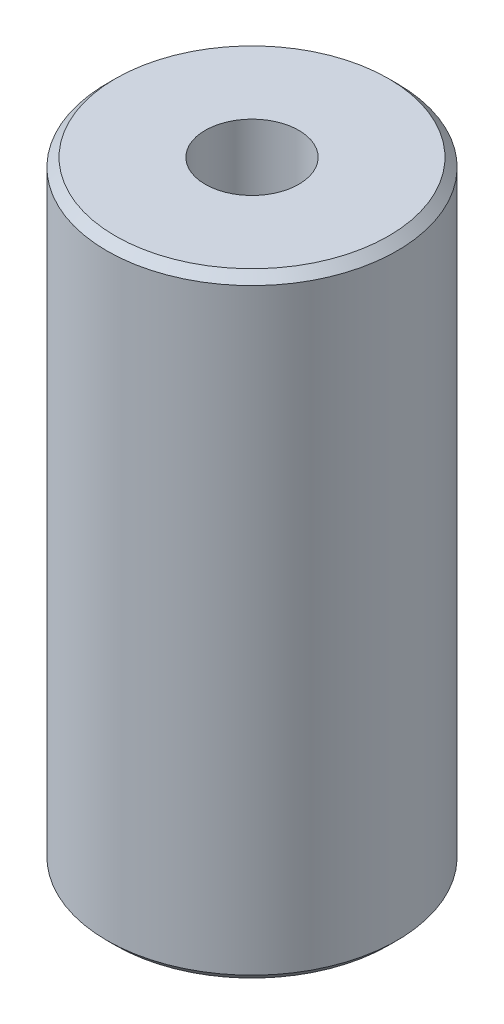
ISO-10303-21;
HEADER;
FILE_DESCRIPTION(('STEP AP214'),'2;1');
FILE_NAME('part.step','',(''),(''),'','','');
FILE_SCHEMA(('AUTOMOTIVE_DESIGN { 1 0 10303 214 1 1 1 1 }'));
ENDSEC;
DATA;
#1=APPLICATION_CONTEXT('core data for automotive mechanical design processes');
#2=APPLICATION_PROTOCOL_DEFINITION('international standard','automotive_design',2000,#1);
#3=PRODUCT_CONTEXT('',#1,'mechanical');
#4=PRODUCT('Part','Part','',(#3));
#5=PRODUCT_RELATED_PRODUCT_CATEGORY('part','',(#4));
#6=PRODUCT_DEFINITION_FORMATION('','',#4);
#7=PRODUCT_DEFINITION_CONTEXT('part definition',#1,'design');
#8=PRODUCT_DEFINITION('design','',#6,#7);
#9=PRODUCT_DEFINITION_SHAPE('','',#8);
#10=(LENGTH_UNIT() NAMED_UNIT(*) SI_UNIT(.MILLI.,.METRE.));
#11=(NAMED_UNIT(*) PLANE_ANGLE_UNIT() SI_UNIT($,.RADIAN.));
#12=(NAMED_UNIT(*) SI_UNIT($,.STERADIAN.) SOLID_ANGLE_UNIT());
#13=UNCERTAINTY_MEASURE_WITH_UNIT(LENGTH_MEASURE(1.E-05),#10,'distance_accuracy_value','');
#14=(GEOMETRIC_REPRESENTATION_CONTEXT(3) GLOBAL_UNCERTAINTY_ASSIGNED_CONTEXT((#13)) GLOBAL_UNIT_ASSIGNED_CONTEXT((#10,
#11,#12)) REPRESENTATION_CONTEXT('',''));
#15=CARTESIAN_POINT('',(0.,0.,0.));
#16=DIRECTION('',(0.,0.,1.));
#17=DIRECTION('',(1.,0.,0.));
#18=AXIS2_PLACEMENT_3D('',#15,#16,#17);
#19=CARTESIAN_POINT('',(0.,95.3009448773312,0.));
#20=DIRECTION('',(0.,-1.,0.));
#21=DIRECTION('',(0.,0.,-1.));
#22=AXIS2_PLACEMENT_3D('',#19,#20,#21);
#23=CYLINDRICAL_SURFACE('',#22,22.5);
#24=CARTESIAN_POINT('',(0.,93.9715668343804,0.));
#25=DIRECTION('',(0.,1.,0.));
#26=DIRECTION('',(0.,0.,1.));
#27=AXIS2_PLACEMENT_3D('',#24,#25,#26);
#28=CIRCLE('',#27,22.5);
#29=CARTESIAN_POINT('',(0.,93.9715668343804,22.5));
#30=VERTEX_POINT('',#29);
#31=EDGE_CURVE('E50',#30,#30,#28,.F.);
#32=ORIENTED_EDGE('',*,*,#31,.T.);
#33=EDGE_LOOP('',(#32));
#34=FACE_BOUND('',#33,.T.);
#35=CARTESIAN_POINT('',(0.,1.32937804295084,0.));
#36=DIRECTION('',(0.,1.,0.));
#37=DIRECTION('',(0.,0.,1.));
#38=AXIS2_PLACEMENT_3D('',#35,#36,#37);
#39=CIRCLE('',#38,22.5);
#40=CARTESIAN_POINT('',(0.,1.32937804295084,22.5));
#41=VERTEX_POINT('',#40);
#42=EDGE_CURVE('E51',#41,#41,#39,.T.);
#43=ORIENTED_EDGE('',*,*,#42,.T.);
#44=EDGE_LOOP('',(#43));
#45=FACE_BOUND('',#44,.T.);
#46=ADVANCED_FACE('F39',(#34,#45),#23,.T.);
#47=CARTESIAN_POINT('',(0.,95.3009448773312,0.));
#48=DIRECTION('',(0.,1.,0.));
#49=DIRECTION('',(0.,0.,1.));
#50=AXIS2_PLACEMENT_3D('',#47,#48,#49);
#51=PLANE('',#50);
#52=CARTESIAN_POINT('',(0.,95.3009448773312,0.));
#53=DIRECTION('',(0.,1.,0.));
#54=DIRECTION('',(0.,0.,1.));
#55=AXIS2_PLACEMENT_3D('',#52,#53,#54);
#56=CIRCLE('',#55,21.1706219570492);
#57=CARTESIAN_POINT('',(0.,95.3009448773312,21.1706219570492));
#58=VERTEX_POINT('',#57);
#59=EDGE_CURVE('E54',#58,#58,#56,.T.);
#60=ORIENTED_EDGE('',*,*,#59,.T.);
#61=EDGE_LOOP('',(#60));
#62=FACE_BOUND('',#61,.T.);
#63=CARTESIAN_POINT('',(0.,95.3009448773312,0.));
#64=DIRECTION('',(0.,1.,0.));
#65=DIRECTION('',(0.,0.,1.));
#66=AXIS2_PLACEMENT_3D('',#63,#64,#65);
#67=CIRCLE('',#66,7.25942289273001);
#68=CARTESIAN_POINT('',(0.,95.3009448773312,7.25942289273001));
#69=VERTEX_POINT('',#68);
#70=EDGE_CURVE('E58',#69,#69,#67,.T.);
#71=ORIENTED_EDGE('',*,*,#70,.F.);
#72=EDGE_LOOP('',(#71));
#73=FACE_BOUND('',#72,.T.);
#74=ADVANCED_FACE('F69',(#62,#73),#51,.T.);
#75=CARTESIAN_POINT('',(0.,0.,0.));
#76=DIRECTION('',(0.,1.,0.));
#77=DIRECTION('',(0.,0.,1.));
#78=AXIS2_PLACEMENT_3D('',#75,#76,#77);
#79=PLANE('',#78);
#80=CARTESIAN_POINT('',(0.,0.,0.));
#81=DIRECTION('',(0.,1.,0.));
#82=DIRECTION('',(0.,0.,1.));
#83=AXIS2_PLACEMENT_3D('',#80,#81,#82);
#84=CIRCLE('',#83,21.1706219570492);
#85=CARTESIAN_POINT('',(0.,0.,21.1706219570492));
#86=VERTEX_POINT('',#85);
#87=EDGE_CURVE('E10',#86,#86,#84,.F.);
#88=ORIENTED_EDGE('',*,*,#87,.T.);
#89=EDGE_LOOP('',(#88));
#90=FACE_BOUND('',#89,.T.);
#91=CARTESIAN_POINT('',(0.,0.,0.));
#92=DIRECTION('',(0.,1.,0.));
#93=DIRECTION('',(0.,0.,1.));
#94=AXIS2_PLACEMENT_3D('',#91,#92,#93);
#95=CIRCLE('',#94,7.25942289273001);
#96=CARTESIAN_POINT('',(0.,0.,7.25942289273001));
#97=VERTEX_POINT('',#96);
#98=EDGE_CURVE('E63',#97,#97,#95,.T.);
#99=ORIENTED_EDGE('',*,*,#98,.T.);
#100=EDGE_LOOP('',(#99));
#101=FACE_BOUND('',#100,.T.);
#102=ADVANCED_FACE('F75',(#90,#101),#79,.F.);
#103=CARTESIAN_POINT('',(0.,95.3009448773312,0.));
#104=DIRECTION('',(0.,-1.,0.));
#105=DIRECTION('',(0.,0.,-1.));
#106=AXIS2_PLACEMENT_3D('',#103,#104,#105);
#107=CYLINDRICAL_SURFACE('',#106,7.25942289273001);
#108=ORIENTED_EDGE('',*,*,#70,.T.);
#109=EDGE_LOOP('',(#108));
#110=FACE_BOUND('',#109,.T.);
#111=ORIENTED_EDGE('',*,*,#98,.F.);
#112=EDGE_LOOP('',(#111));
#113=FACE_BOUND('',#112,.T.);
#114=ADVANCED_FACE('F70',(#110,#113),#107,.F.);
#115=CARTESIAN_POINT('',(0.,95.3009448773312,0.));
#116=DIRECTION('',(0.,-1.,0.));
#117=DIRECTION('',(0.,0.,-1.));
#118=AXIS2_PLACEMENT_3D('',#115,#116,#117);
#119=CONICAL_SURFACE('',#118,21.1706219570492,0.785398163397446);
#120=ORIENTED_EDGE('',*,*,#31,.F.);
#121=EDGE_LOOP('',(#120));
#122=FACE_BOUND('',#121,.T.);
#123=ORIENTED_EDGE('',*,*,#59,.F.);
#124=EDGE_LOOP('',(#123));
#125=FACE_BOUND('',#124,.T.);
#126=ADVANCED_FACE('F81',(#122,#125),#119,.T.);
#127=CARTESIAN_POINT('',(0.,1.32937804295084,0.));
#128=DIRECTION('',(0.,1.,0.));
#129=DIRECTION('',(0.,0.,1.));
#130=AXIS2_PLACEMENT_3D('',#127,#128,#129);
#131=CONICAL_SURFACE('',#130,22.5,0.785398163397451);
#132=ORIENTED_EDGE('',*,*,#87,.F.);
#133=EDGE_LOOP('',(#132));
#134=FACE_BOUND('',#133,.T.);
#135=ORIENTED_EDGE('',*,*,#42,.F.);
#136=EDGE_LOOP('',(#135));
#137=FACE_BOUND('',#136,.T.);
#138=ADVANCED_FACE('F45',(#134,#137),#131,.T.);
#139=CLOSED_SHELL('',(#46,#74,#102,#114,#126,#138));
#140=MANIFOLD_SOLID_BREP('B2',#139);
#141=ADVANCED_BREP_SHAPE_REPRESENTATION('',(#18,#140),#14);
#142=SHAPE_DEFINITION_REPRESENTATION(#9,#141);
ENDSEC;
END-ISO-10303-21;
